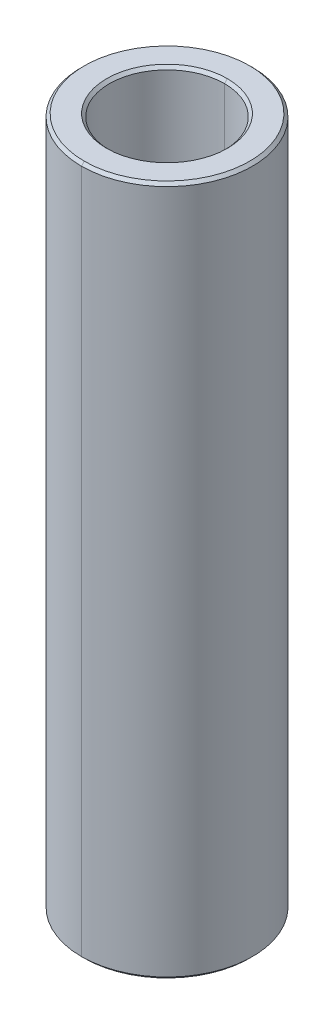
ISO-10303-21;
HEADER;
FILE_DESCRIPTION(('STEP AP214'),'2;1');
FILE_NAME('part.step','',(''),(''),'','','');
FILE_SCHEMA(('AUTOMOTIVE_DESIGN { 1 0 10303 214 1 1 1 1 }'));
ENDSEC;
DATA;
#1=APPLICATION_CONTEXT('core data for automotive mechanical design processes');
#2=APPLICATION_PROTOCOL_DEFINITION('international standard','automotive_design',2000,#1);
#3=PRODUCT_CONTEXT('',#1,'mechanical');
#4=PRODUCT('Part','Part','',(#3));
#5=PRODUCT_RELATED_PRODUCT_CATEGORY('part','',(#4));
#6=PRODUCT_DEFINITION_FORMATION('','',#4);
#7=PRODUCT_DEFINITION_CONTEXT('part definition',#1,'design');
#8=PRODUCT_DEFINITION('design','',#6,#7);
#9=PRODUCT_DEFINITION_SHAPE('','',#8);
#10=(LENGTH_UNIT() NAMED_UNIT(*) SI_UNIT(.MILLI.,.METRE.));
#11=(NAMED_UNIT(*) PLANE_ANGLE_UNIT() SI_UNIT($,.RADIAN.));
#12=(NAMED_UNIT(*) SI_UNIT($,.STERADIAN.) SOLID_ANGLE_UNIT());
#13=UNCERTAINTY_MEASURE_WITH_UNIT(LENGTH_MEASURE(1.E-05),#10,'distance_accuracy_value','');
#14=(GEOMETRIC_REPRESENTATION_CONTEXT(3) GLOBAL_UNCERTAINTY_ASSIGNED_CONTEXT((#13)) GLOBAL_UNIT_ASSIGNED_CONTEXT((#10,
#11,#12)) REPRESENTATION_CONTEXT('',''));
#15=CARTESIAN_POINT('',(0.,0.,0.));
#16=DIRECTION('',(0.,0.,1.));
#17=DIRECTION('',(1.,0.,0.));
#18=AXIS2_PLACEMENT_3D('',#15,#16,#17);
#19=CARTESIAN_POINT('',(0.,11.9,0.));
#20=DIRECTION('',(0.,1.,0.));
#21=DIRECTION('',(0.,0.,1.));
#22=AXIS2_PLACEMENT_3D('',#19,#20,#21);
#23=CONICAL_SURFACE('',#22,2.,0.785398163397448);
#24=DIRECTION('',(0.,0.707106781186548,-0.707106781186548));
#25=VECTOR('',#24,1.);
#26=CARTESIAN_POINT('',(0.,11.9,-2.));
#27=LINE('',#26,#25);
#28=CARTESIAN_POINT('',(0.,11.9,-2.));
#29=VERTEX_POINT('',#28);
#30=CARTESIAN_POINT('',(0.,12.,-2.1));
#31=VERTEX_POINT('',#30);
#32=EDGE_CURVE('E146',#29,#31,#27,.T.);
#33=ORIENTED_EDGE('',*,*,#32,.F.);
#34=CARTESIAN_POINT('',(0.,11.9,0.));
#35=DIRECTION('',(0.,1.,0.));
#36=DIRECTION('',(0.,0.,1.));
#37=AXIS2_PLACEMENT_3D('',#34,#35,#36);
#38=CIRCLE('',#37,2.);
#39=CARTESIAN_POINT('',(0.,11.9,2.));
#40=VERTEX_POINT('',#39);
#41=EDGE_CURVE('E23',#40,#29,#38,.T.);
#42=ORIENTED_EDGE('',*,*,#41,.F.);
#43=DIRECTION('',(0.,0.707106781186548,0.707106781186548));
#44=VECTOR('',#43,1.);
#45=CARTESIAN_POINT('',(0.,11.9,2.));
#46=LINE('',#45,#44);
#47=CARTESIAN_POINT('',(0.,12.,2.1));
#48=VERTEX_POINT('',#47);
#49=EDGE_CURVE('E145',#40,#48,#46,.T.);
#50=ORIENTED_EDGE('',*,*,#49,.T.);
#51=CARTESIAN_POINT('',(0.,12.,0.));
#52=DIRECTION('',(0.,-1.,0.));
#53=DIRECTION('',(0.,0.,1.));
#54=AXIS2_PLACEMENT_3D('',#51,#52,#53);
#55=CIRCLE('',#54,2.1);
#56=EDGE_CURVE('E108',#31,#48,#55,.T.);
#57=ORIENTED_EDGE('',*,*,#56,.F.);
#58=EDGE_LOOP('',(#33,#42,#50,#57));
#59=FACE_BOUND('',#58,.T.);
#60=ADVANCED_FACE('F14',(#59),#23,.F.);
#61=CARTESIAN_POINT('',(0.,-12.,0.));
#62=DIRECTION('',(0.,-1.,0.));
#63=DIRECTION('',(0.,0.,-1.));
#64=AXIS2_PLACEMENT_3D('',#61,#62,#63);
#65=CONICAL_SURFACE('',#64,2.1,0.785398163397457);
#66=DIRECTION('',(0.,-0.707106781186542,0.707106781186554));
#67=VECTOR('',#66,1.);
#68=CARTESIAN_POINT('',(0.,-12.,2.1));
#69=LINE('',#68,#67);
#70=CARTESIAN_POINT('',(0.,-11.9,2.));
#71=VERTEX_POINT('',#70);
#72=CARTESIAN_POINT('',(0.,-12.,2.1));
#73=VERTEX_POINT('',#72);
#74=EDGE_CURVE('E140',#71,#73,#69,.T.);
#75=ORIENTED_EDGE('',*,*,#74,.F.);
#76=CARTESIAN_POINT('',(0.,-11.9,0.));
#77=DIRECTION('',(0.,-1.,0.));
#78=DIRECTION('',(0.,0.,1.));
#79=AXIS2_PLACEMENT_3D('',#76,#77,#78);
#80=CIRCLE('',#79,2.);
#81=CARTESIAN_POINT('',(0.,-11.9,-2.));
#82=VERTEX_POINT('',#81);
#83=EDGE_CURVE('E9',#82,#71,#80,.T.);
#84=ORIENTED_EDGE('',*,*,#83,.F.);
#85=DIRECTION('',(0.,-0.707106781186542,-0.707106781186554));
#86=VECTOR('',#85,1.);
#87=CARTESIAN_POINT('',(0.,-12.,-2.1));
#88=LINE('',#87,#86);
#89=CARTESIAN_POINT('',(0.,-12.,-2.1));
#90=VERTEX_POINT('',#89);
#91=EDGE_CURVE('E139',#82,#90,#88,.T.);
#92=ORIENTED_EDGE('',*,*,#91,.T.);
#93=CARTESIAN_POINT('',(0.,-12.,0.));
#94=DIRECTION('',(0.,1.,0.));
#95=DIRECTION('',(0.,0.,1.));
#96=AXIS2_PLACEMENT_3D('',#93,#94,#95);
#97=CIRCLE('',#96,2.1);
#98=EDGE_CURVE('E107',#73,#90,#97,.T.);
#99=ORIENTED_EDGE('',*,*,#98,.F.);
#100=EDGE_LOOP('',(#75,#84,#92,#99));
#101=FACE_BOUND('',#100,.T.);
#102=ADVANCED_FACE('F255',(#101),#65,.F.);
#103=CARTESIAN_POINT('',(0.,12.,0.));
#104=DIRECTION('',(0.,-1.,0.));
#105=DIRECTION('',(0.,0.,-1.));
#106=AXIS2_PLACEMENT_3D('',#103,#104,#105);
#107=CONICAL_SURFACE('',#106,2.875,0.78539816339744);
#108=DIRECTION('',(0.,-0.707106781186554,0.707106781186542));
#109=VECTOR('',#108,1.);
#110=CARTESIAN_POINT('',(0.,12.,2.875));
#111=LINE('',#110,#109);
#112=CARTESIAN_POINT('',(0.,12.,2.875));
#113=VERTEX_POINT('',#112);
#114=CARTESIAN_POINT('',(0.,11.9,2.975));
#115=VERTEX_POINT('',#114);
#116=EDGE_CURVE('E180',#113,#115,#111,.T.);
#117=ORIENTED_EDGE('',*,*,#116,.F.);
#118=CARTESIAN_POINT('',(0.,12.,0.));
#119=DIRECTION('',(0.,1.,0.));
#120=DIRECTION('',(0.,0.,1.));
#121=AXIS2_PLACEMENT_3D('',#118,#119,#120);
#122=CIRCLE('',#121,2.875);
#123=CARTESIAN_POINT('',(0.,12.,-2.875));
#124=VERTEX_POINT('',#123);
#125=EDGE_CURVE('E178',#124,#113,#122,.T.);
#126=ORIENTED_EDGE('',*,*,#125,.F.);
#127=DIRECTION('',(0.,-0.707106781186554,-0.707106781186542));
#128=VECTOR('',#127,1.);
#129=CARTESIAN_POINT('',(0.,12.,-2.875));
#130=LINE('',#129,#128);
#131=CARTESIAN_POINT('',(0.,11.9,-2.975));
#132=VERTEX_POINT('',#131);
#133=EDGE_CURVE('E120',#124,#132,#130,.T.);
#134=ORIENTED_EDGE('',*,*,#133,.T.);
#135=CARTESIAN_POINT('',(0.,11.9,0.));
#136=DIRECTION('',(0.,-1.,0.));
#137=DIRECTION('',(0.,0.,1.));
#138=AXIS2_PLACEMENT_3D('',#135,#136,#137);
#139=CIRCLE('',#138,2.975);
#140=EDGE_CURVE('E152',#115,#132,#139,.T.);
#141=ORIENTED_EDGE('',*,*,#140,.F.);
#142=EDGE_LOOP('',(#117,#126,#134,#141));
#143=FACE_BOUND('',#142,.T.);
#144=ADVANCED_FACE('F211',(#143),#107,.T.);
#145=CARTESIAN_POINT('',(0.,-11.9,0.));
#146=DIRECTION('',(0.,1.,0.));
#147=DIRECTION('',(0.,0.,1.));
#148=AXIS2_PLACEMENT_3D('',#145,#146,#147);
#149=CONICAL_SURFACE('',#148,2.975,0.785398163397448);
#150=DIRECTION('',(0.,0.707106781186548,-0.707106781186548));
#151=VECTOR('',#150,1.);
#152=CARTESIAN_POINT('',(0.,-11.9,-2.975));
#153=LINE('',#152,#151);
#154=CARTESIAN_POINT('',(0.,-12.,-2.875));
#155=VERTEX_POINT('',#154);
#156=CARTESIAN_POINT('',(0.,-11.9,-2.975));
#157=VERTEX_POINT('',#156);
#158=EDGE_CURVE('E102',#155,#157,#153,.T.);
#159=ORIENTED_EDGE('',*,*,#158,.F.);
#160=CARTESIAN_POINT('',(0.,-12.,0.));
#161=DIRECTION('',(0.,-1.,0.));
#162=DIRECTION('',(0.,0.,1.));
#163=AXIS2_PLACEMENT_3D('',#160,#161,#162);
#164=CIRCLE('',#163,2.875);
#165=CARTESIAN_POINT('',(0.,-12.,2.875));
#166=VERTEX_POINT('',#165);
#167=EDGE_CURVE('E96',#166,#155,#164,.T.);
#168=ORIENTED_EDGE('',*,*,#167,.F.);
#169=DIRECTION('',(0.,0.707106781186548,0.707106781186548));
#170=VECTOR('',#169,1.);
#171=CARTESIAN_POINT('',(0.,-11.9,2.975));
#172=LINE('',#171,#170);
#173=CARTESIAN_POINT('',(0.,-11.9,2.975));
#174=VERTEX_POINT('',#173);
#175=EDGE_CURVE('E99',#166,#174,#172,.T.);
#176=ORIENTED_EDGE('',*,*,#175,.T.);
#177=CARTESIAN_POINT('',(0.,-11.9,0.));
#178=DIRECTION('',(0.,1.,0.));
#179=DIRECTION('',(0.,0.,1.));
#180=AXIS2_PLACEMENT_3D('',#177,#178,#179);
#181=CIRCLE('',#180,2.975);
#182=EDGE_CURVE('E36',#157,#174,#181,.T.);
#183=ORIENTED_EDGE('',*,*,#182,.F.);
#184=EDGE_LOOP('',(#159,#168,#176,#183));
#185=FACE_BOUND('',#184,.T.);
#186=ADVANCED_FACE('F98',(#185),#149,.T.);
#187=CARTESIAN_POINT('',(0.,12.,0.));
#188=DIRECTION('',(0.,-1.,0.));
#189=DIRECTION('',(0.,0.,-1.));
#190=AXIS2_PLACEMENT_3D('',#187,#188,#189);
#191=CYLINDRICAL_SURFACE('',#190,2.);
#192=DIRECTION('',(0.,-1.,0.));
#193=VECTOR('',#192,1.);
#194=CARTESIAN_POINT('',(0.,12.,2.));
#195=LINE('',#194,#193);
#196=EDGE_CURVE('E116',#40,#71,#195,.T.);
#197=ORIENTED_EDGE('',*,*,#196,.F.);
#198=ORIENTED_EDGE('',*,*,#41,.T.);
#199=DIRECTION('',(0.,-1.,0.));
#200=VECTOR('',#199,1.);
#201=CARTESIAN_POINT('',(0.,12.,-2.));
#202=LINE('',#201,#200);
#203=EDGE_CURVE('E187',#29,#82,#202,.T.);
#204=ORIENTED_EDGE('',*,*,#203,.T.);
#205=ORIENTED_EDGE('',*,*,#83,.T.);
#206=EDGE_LOOP('',(#197,#198,#204,#205));
#207=FACE_BOUND('',#206,.T.);
#208=ADVANCED_FACE('F267',(#207),#191,.F.);
#209=CARTESIAN_POINT('',(0.,12.,0.));
#210=DIRECTION('',(0.,-1.,0.));
#211=DIRECTION('',(0.,0.,-1.));
#212=AXIS2_PLACEMENT_3D('',#209,#210,#211);
#213=CYLINDRICAL_SURFACE('',#212,2.975);
#214=DIRECTION('',(0.,-1.,0.));
#215=VECTOR('',#214,1.);
#216=CARTESIAN_POINT('',(0.,12.,2.975));
#217=LINE('',#216,#215);
#218=EDGE_CURVE('E134',#115,#174,#217,.T.);
#219=ORIENTED_EDGE('',*,*,#218,.F.);
#220=ORIENTED_EDGE('',*,*,#140,.T.);
#221=DIRECTION('',(0.,-1.,0.));
#222=VECTOR('',#221,1.);
#223=CARTESIAN_POINT('',(0.,12.,-2.975));
#224=LINE('',#223,#222);
#225=EDGE_CURVE('E213',#132,#157,#224,.T.);
#226=ORIENTED_EDGE('',*,*,#225,.T.);
#227=ORIENTED_EDGE('',*,*,#182,.T.);
#228=EDGE_LOOP('',(#219,#220,#226,#227));
#229=FACE_BOUND('',#228,.T.);
#230=ADVANCED_FACE('F249',(#229),#213,.T.);
#231=CARTESIAN_POINT('',(0.,-12.,0.));
#232=DIRECTION('',(0.,1.,0.));
#233=DIRECTION('',(1.,0.,0.));
#234=AXIS2_PLACEMENT_3D('',#231,#232,#233);
#235=PLANE('',#234);
#236=CARTESIAN_POINT('',(0.,-12.,0.));
#237=DIRECTION('',(0.,1.,0.));
#238=DIRECTION('',(0.,0.,1.));
#239=AXIS2_PLACEMENT_3D('',#236,#237,#238);
#240=CIRCLE('',#239,2.1);
#241=EDGE_CURVE('E136',#90,#73,#240,.T.);
#242=ORIENTED_EDGE('',*,*,#241,.T.);
#243=ORIENTED_EDGE('',*,*,#98,.T.);
#244=EDGE_LOOP('',(#242,#243));
#245=FACE_BOUND('',#244,.T.);
#246=ORIENTED_EDGE('',*,*,#167,.T.);
#247=CARTESIAN_POINT('',(0.,-12.,0.));
#248=DIRECTION('',(0.,-1.,0.));
#249=DIRECTION('',(0.,0.,1.));
#250=AXIS2_PLACEMENT_3D('',#247,#248,#249);
#251=CIRCLE('',#250,2.875);
#252=EDGE_CURVE('E112',#155,#166,#251,.T.);
#253=ORIENTED_EDGE('',*,*,#252,.T.);
#254=EDGE_LOOP('',(#246,#253));
#255=FACE_BOUND('',#254,.T.);
#256=ADVANCED_FACE('F118',(#245,#255),#235,.F.);
#257=CARTESIAN_POINT('',(0.,12.,0.));
#258=DIRECTION('',(0.,1.,0.));
#259=DIRECTION('',(1.,0.,0.));
#260=AXIS2_PLACEMENT_3D('',#257,#258,#259);
#261=PLANE('',#260);
#262=CARTESIAN_POINT('',(0.,12.,0.));
#263=DIRECTION('',(0.,-1.,0.));
#264=DIRECTION('',(0.,0.,1.));
#265=AXIS2_PLACEMENT_3D('',#262,#263,#264);
#266=CIRCLE('',#265,2.1);
#267=EDGE_CURVE('E141',#48,#31,#266,.T.);
#268=ORIENTED_EDGE('',*,*,#267,.T.);
#269=ORIENTED_EDGE('',*,*,#56,.T.);
#270=EDGE_LOOP('',(#268,#269));
#271=FACE_BOUND('',#270,.T.);
#272=ORIENTED_EDGE('',*,*,#125,.T.);
#273=CARTESIAN_POINT('',(0.,12.,0.));
#274=DIRECTION('',(0.,1.,0.));
#275=DIRECTION('',(0.,0.,1.));
#276=AXIS2_PLACEMENT_3D('',#273,#274,#275);
#277=CIRCLE('',#276,2.875);
#278=EDGE_CURVE('E170',#113,#124,#277,.T.);
#279=ORIENTED_EDGE('',*,*,#278,.T.);
#280=EDGE_LOOP('',(#272,#279));
#281=FACE_BOUND('',#280,.T.);
#282=ADVANCED_FACE('F202',(#271,#281),#261,.T.);
#283=CARTESIAN_POINT('',(0.,12.,0.));
#284=DIRECTION('',(0.,-1.,0.));
#285=DIRECTION('',(0.,0.,-1.));
#286=AXIS2_PLACEMENT_3D('',#283,#284,#285);
#287=CYLINDRICAL_SURFACE('',#286,2.975);
#288=CARTESIAN_POINT('',(0.,11.9,0.));
#289=DIRECTION('',(0.,-1.,0.));
#290=DIRECTION('',(0.,0.,1.));
#291=AXIS2_PLACEMENT_3D('',#288,#289,#290);
#292=CIRCLE('',#291,2.975);
#293=EDGE_CURVE('E130',#132,#115,#292,.T.);
#294=ORIENTED_EDGE('',*,*,#293,.T.);
#295=ORIENTED_EDGE('',*,*,#218,.T.);
#296=CARTESIAN_POINT('',(0.,-11.9,0.));
#297=DIRECTION('',(0.,1.,0.));
#298=DIRECTION('',(0.,0.,1.));
#299=AXIS2_PLACEMENT_3D('',#296,#297,#298);
#300=CIRCLE('',#299,2.975);
#301=EDGE_CURVE('E114',#174,#157,#300,.T.);
#302=ORIENTED_EDGE('',*,*,#301,.T.);
#303=ORIENTED_EDGE('',*,*,#225,.F.);
#304=EDGE_LOOP('',(#294,#295,#302,#303));
#305=FACE_BOUND('',#304,.T.);
#306=ADVANCED_FACE('F239',(#305),#287,.T.);
#307=CARTESIAN_POINT('',(0.,12.,0.));
#308=DIRECTION('',(0.,-1.,0.));
#309=DIRECTION('',(0.,0.,-1.));
#310=AXIS2_PLACEMENT_3D('',#307,#308,#309);
#311=CYLINDRICAL_SURFACE('',#310,2.);
#312=CARTESIAN_POINT('',(0.,11.9,0.));
#313=DIRECTION('',(0.,1.,0.));
#314=DIRECTION('',(0.,0.,1.));
#315=AXIS2_PLACEMENT_3D('',#312,#313,#314);
#316=CIRCLE('',#315,2.);
#317=EDGE_CURVE('E147',#29,#40,#316,.T.);
#318=ORIENTED_EDGE('',*,*,#317,.T.);
#319=ORIENTED_EDGE('',*,*,#196,.T.);
#320=CARTESIAN_POINT('',(0.,-11.9,0.));
#321=DIRECTION('',(0.,-1.,0.));
#322=DIRECTION('',(0.,0.,1.));
#323=AXIS2_PLACEMENT_3D('',#320,#321,#322);
#324=CIRCLE('',#323,2.);
#325=EDGE_CURVE('E176',#71,#82,#324,.T.);
#326=ORIENTED_EDGE('',*,*,#325,.T.);
#327=ORIENTED_EDGE('',*,*,#203,.F.);
#328=EDGE_LOOP('',(#318,#319,#326,#327));
#329=FACE_BOUND('',#328,.T.);
#330=ADVANCED_FACE('F246',(#329),#311,.F.);
#331=CARTESIAN_POINT('',(0.,-11.9,0.));
#332=DIRECTION('',(0.,1.,0.));
#333=DIRECTION('',(0.,0.,1.));
#334=AXIS2_PLACEMENT_3D('',#331,#332,#333);
#335=CONICAL_SURFACE('',#334,2.975,0.785398163397448);
#336=ORIENTED_EDGE('',*,*,#252,.F.);
#337=ORIENTED_EDGE('',*,*,#158,.T.);
#338=ORIENTED_EDGE('',*,*,#301,.F.);
#339=ORIENTED_EDGE('',*,*,#175,.F.);
#340=EDGE_LOOP('',(#336,#337,#338,#339));
#341=FACE_BOUND('',#340,.T.);
#342=ADVANCED_FACE('F111',(#341),#335,.T.);
#343=CARTESIAN_POINT('',(0.,12.,0.));
#344=DIRECTION('',(0.,-1.,0.));
#345=DIRECTION('',(0.,0.,-1.));
#346=AXIS2_PLACEMENT_3D('',#343,#344,#345);
#347=CONICAL_SURFACE('',#346,2.875,0.78539816339744);
#348=ORIENTED_EDGE('',*,*,#278,.F.);
#349=ORIENTED_EDGE('',*,*,#116,.T.);
#350=ORIENTED_EDGE('',*,*,#293,.F.);
#351=ORIENTED_EDGE('',*,*,#133,.F.);
#352=EDGE_LOOP('',(#348,#349,#350,#351));
#353=FACE_BOUND('',#352,.T.);
#354=ADVANCED_FACE('F206',(#353),#347,.T.);
#355=CARTESIAN_POINT('',(0.,-12.,0.));
#356=DIRECTION('',(0.,-1.,0.));
#357=DIRECTION('',(0.,0.,-1.));
#358=AXIS2_PLACEMENT_3D('',#355,#356,#357);
#359=CONICAL_SURFACE('',#358,2.1,0.785398163397457);
#360=ORIENTED_EDGE('',*,*,#325,.F.);
#361=ORIENTED_EDGE('',*,*,#74,.T.);
#362=ORIENTED_EDGE('',*,*,#241,.F.);
#363=ORIENTED_EDGE('',*,*,#91,.F.);
#364=EDGE_LOOP('',(#360,#361,#362,#363));
#365=FACE_BOUND('',#364,.T.);
#366=ADVANCED_FACE('F269',(#365),#359,.F.);
#367=CARTESIAN_POINT('',(0.,11.9,0.));
#368=DIRECTION('',(0.,1.,0.));
#369=DIRECTION('',(0.,0.,1.));
#370=AXIS2_PLACEMENT_3D('',#367,#368,#369);
#371=CONICAL_SURFACE('',#370,2.,0.785398163397448);
#372=ORIENTED_EDGE('',*,*,#317,.F.);
#373=ORIENTED_EDGE('',*,*,#32,.T.);
#374=ORIENTED_EDGE('',*,*,#267,.F.);
#375=ORIENTED_EDGE('',*,*,#49,.F.);
#376=EDGE_LOOP('',(#372,#373,#374,#375));
#377=FACE_BOUND('',#376,.T.);
#378=ADVANCED_FACE('F233',(#377),#371,.F.);
#379=CLOSED_SHELL('',(#60,#102,#144,#186,#208,#230,#256,#282,#306,#330,#342,#354,#366,#378));
#380=MANIFOLD_SOLID_BREP('B1',#379);
#381=ADVANCED_BREP_SHAPE_REPRESENTATION('',(#18,#380),#14);
#382=SHAPE_DEFINITION_REPRESENTATION(#9,#381);
ENDSEC;
END-ISO-10303-21;
